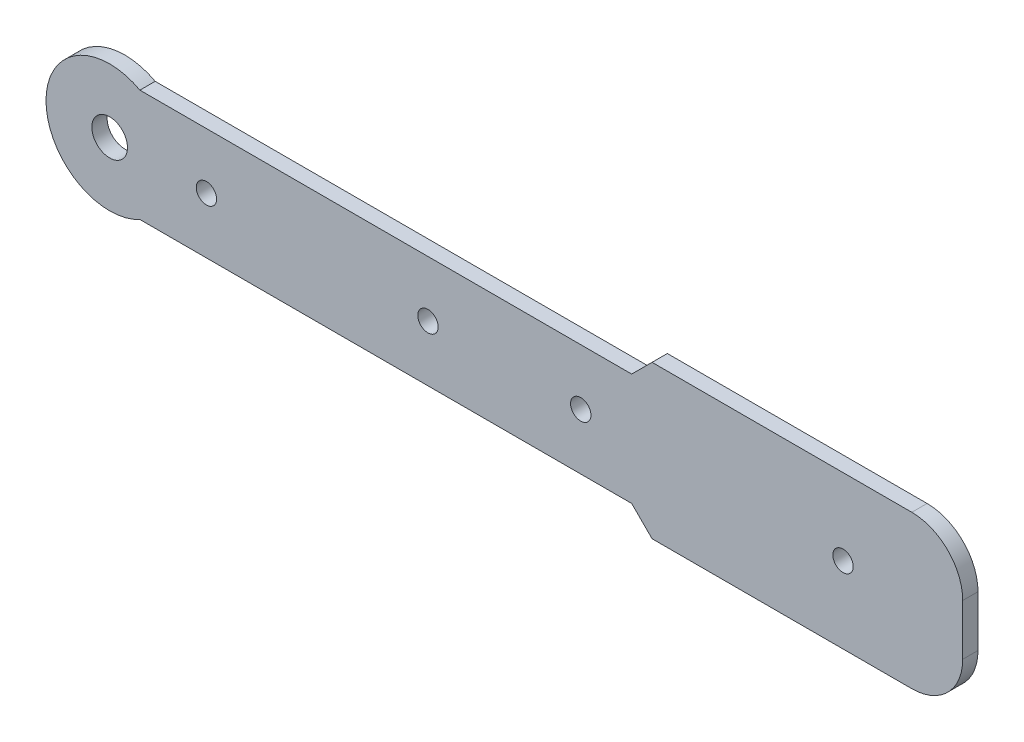
ISO-10303-21;
HEADER;
FILE_DESCRIPTION(('STEP AP214'),'2;1');
FILE_NAME('part.step','',(''),(''),'','','');
FILE_SCHEMA(('AUTOMOTIVE_DESIGN { 1 0 10303 214 1 1 1 1 }'));
ENDSEC;
DATA;
#1=APPLICATION_CONTEXT('core data for automotive mechanical design processes');
#2=APPLICATION_PROTOCOL_DEFINITION('international standard','automotive_design',2000,#1);
#3=PRODUCT_CONTEXT('',#1,'mechanical');
#4=PRODUCT('Part','Part','',(#3));
#5=PRODUCT_RELATED_PRODUCT_CATEGORY('part','',(#4));
#6=PRODUCT_DEFINITION_FORMATION('','',#4);
#7=PRODUCT_DEFINITION_CONTEXT('part definition',#1,'design');
#8=PRODUCT_DEFINITION('design','',#6,#7);
#9=PRODUCT_DEFINITION_SHAPE('','',#8);
#10=(LENGTH_UNIT() NAMED_UNIT(*) SI_UNIT(.MILLI.,.METRE.));
#11=(NAMED_UNIT(*) PLANE_ANGLE_UNIT() SI_UNIT($,.RADIAN.));
#12=(NAMED_UNIT(*) SI_UNIT($,.STERADIAN.) SOLID_ANGLE_UNIT());
#13=UNCERTAINTY_MEASURE_WITH_UNIT(LENGTH_MEASURE(1.E-05),#10,'distance_accuracy_value','');
#14=(GEOMETRIC_REPRESENTATION_CONTEXT(3) GLOBAL_UNCERTAINTY_ASSIGNED_CONTEXT((#13)) GLOBAL_UNIT_ASSIGNED_CONTEXT((#10,
#11,#12)) REPRESENTATION_CONTEXT('',''));
#15=CARTESIAN_POINT('',(0.,0.,0.));
#16=DIRECTION('',(0.,0.,1.));
#17=DIRECTION('',(1.,0.,0.));
#18=AXIS2_PLACEMENT_3D('',#15,#16,#17);
#19=CARTESIAN_POINT('',(25.,15.,3.));
#20=DIRECTION('',(0.,-1.,0.));
#21=DIRECTION('',(1.,0.,0.));
#22=AXIS2_PLACEMENT_3D('',#19,#20,#21);
#23=PLANE('',#22);
#24=DIRECTION('',(-1.,0.,0.));
#25=VECTOR('',#24,1.);
#26=CARTESIAN_POINT('',(25.,15.,0.));
#27=LINE('',#26,#25);
#28=CARTESIAN_POINT('',(80.,15.,0.));
#29=VERTEX_POINT('',#28);
#30=CARTESIAN_POINT('',(29.,15.,0.));
#31=VERTEX_POINT('',#30);
#32=EDGE_CURVE('E245',#29,#31,#27,.T.);
#33=ORIENTED_EDGE('',*,*,#32,.T.);
#34=DIRECTION('',(0.,0.,1.));
#35=VECTOR('',#34,1.);
#36=CARTESIAN_POINT('',(29.,15.,3.));
#37=LINE('',#36,#35);
#38=CARTESIAN_POINT('',(29.,15.,3.));
#39=VERTEX_POINT('',#38);
#40=EDGE_CURVE('E11',#31,#39,#37,.T.);
#41=ORIENTED_EDGE('',*,*,#40,.T.);
#42=DIRECTION('',(-1.,0.,0.));
#43=VECTOR('',#42,1.);
#44=CARTESIAN_POINT('',(25.,15.,3.));
#45=LINE('',#44,#43);
#46=CARTESIAN_POINT('',(80.,15.,3.));
#47=VERTEX_POINT('',#46);
#48=EDGE_CURVE('E128',#47,#39,#45,.T.);
#49=ORIENTED_EDGE('',*,*,#48,.F.);
#50=DIRECTION('',(0.,0.,-1.));
#51=VECTOR('',#50,1.);
#52=CARTESIAN_POINT('',(80.,15.,3.));
#53=LINE('',#52,#51);
#54=EDGE_CURVE('E175',#47,#29,#53,.T.);
#55=ORIENTED_EDGE('',*,*,#54,.T.);
#56=EDGE_LOOP('',(#33,#41,#49,#55));
#57=FACE_BOUND('',#56,.T.);
#58=ADVANCED_FACE('F45',(#57),#23,.F.);
#59=CARTESIAN_POINT('',(-25.,11.,3.));
#60=DIRECTION('',(0.,-1.,0.));
#61=DIRECTION('',(0.,0.,-1.));
#62=AXIS2_PLACEMENT_3D('',#59,#60,#61);
#63=PLANE('',#62);
#64=DIRECTION('',(-1.,0.,0.));
#65=VECTOR('',#64,1.);
#66=CARTESIAN_POINT('',(-25.,11.,0.));
#67=LINE('',#66,#65);
#68=CARTESIAN_POINT('',(25.,11.,0.));
#69=VERTEX_POINT('',#68);
#70=CARTESIAN_POINT('',(-71.562828956481,11.,0.));
#71=VERTEX_POINT('',#70);
#72=EDGE_CURVE('E223',#69,#71,#67,.T.);
#73=ORIENTED_EDGE('',*,*,#72,.T.);
#74=DIRECTION('',(0.,0.,-1.));
#75=VECTOR('',#74,1.);
#76=CARTESIAN_POINT('',(-71.562828956481,11.,3.));
#77=LINE('',#76,#75);
#78=CARTESIAN_POINT('',(-71.562828956481,11.,3.));
#79=VERTEX_POINT('',#78);
#80=EDGE_CURVE('E139',#79,#71,#77,.T.);
#81=ORIENTED_EDGE('',*,*,#80,.F.);
#82=DIRECTION('',(-1.,0.,0.));
#83=VECTOR('',#82,1.);
#84=CARTESIAN_POINT('',(-25.,11.,3.));
#85=LINE('',#84,#83);
#86=CARTESIAN_POINT('',(25.,11.,3.));
#87=VERTEX_POINT('',#86);
#88=EDGE_CURVE('E126',#87,#79,#85,.T.);
#89=ORIENTED_EDGE('',*,*,#88,.F.);
#90=DIRECTION('',(0.,0.,-1.));
#91=VECTOR('',#90,1.);
#92=CARTESIAN_POINT('',(25.,11.,3.));
#93=LINE('',#92,#91);
#94=EDGE_CURVE('E137',#87,#69,#93,.T.);
#95=ORIENTED_EDGE('',*,*,#94,.T.);
#96=EDGE_LOOP('',(#73,#81,#89,#95));
#97=FACE_BOUND('',#96,.T.);
#98=ADVANCED_FACE('F136',(#97),#63,.F.);
#99=CARTESIAN_POINT('',(-77.5,0.,3.));
#100=DIRECTION('',(0.,0.,-1.));
#101=DIRECTION('',(-1.,0.,0.));
#102=AXIS2_PLACEMENT_3D('',#99,#100,#101);
#103=CYLINDRICAL_SURFACE('',#102,12.5);
#104=CARTESIAN_POINT('',(-77.5,0.,0.));
#105=DIRECTION('',(0.,0.,1.));
#106=DIRECTION('',(1.,0.,0.));
#107=AXIS2_PLACEMENT_3D('',#104,#105,#106);
#108=CIRCLE('',#107,12.5);
#109=CARTESIAN_POINT('',(-71.562828956481,-11.,0.));
#110=VERTEX_POINT('',#109);
#111=EDGE_CURVE('E217',#71,#110,#108,.T.);
#112=ORIENTED_EDGE('',*,*,#111,.T.);
#113=DIRECTION('',(0.,0.,-1.));
#114=VECTOR('',#113,1.);
#115=CARTESIAN_POINT('',(-71.562828956481,-11.,3.));
#116=LINE('',#115,#114);
#117=CARTESIAN_POINT('',(-71.562828956481,-11.,3.));
#118=VERTEX_POINT('',#117);
#119=EDGE_CURVE('E151',#118,#110,#116,.T.);
#120=ORIENTED_EDGE('',*,*,#119,.F.);
#121=CARTESIAN_POINT('',(-77.5,0.,3.));
#122=DIRECTION('',(0.,0.,1.));
#123=DIRECTION('',(1.,0.,0.));
#124=AXIS2_PLACEMENT_3D('',#121,#122,#123);
#125=CIRCLE('',#124,12.5);
#126=EDGE_CURVE('E142',#79,#118,#125,.T.);
#127=ORIENTED_EDGE('',*,*,#126,.F.);
#128=ORIENTED_EDGE('',*,*,#80,.T.);
#129=EDGE_LOOP('',(#112,#120,#127,#128));
#130=FACE_BOUND('',#129,.T.);
#131=ADVANCED_FACE('F250',(#130),#103,.T.);
#132=CARTESIAN_POINT('',(-25.,-11.,3.));
#133=DIRECTION('',(0.,1.,0.));
#134=DIRECTION('',(0.,0.,1.));
#135=AXIS2_PLACEMENT_3D('',#132,#133,#134);
#136=PLANE('',#135);
#137=DIRECTION('',(1.,0.,0.));
#138=VECTOR('',#137,1.);
#139=CARTESIAN_POINT('',(-25.,-11.,0.));
#140=LINE('',#139,#138);
#141=CARTESIAN_POINT('',(25.,-11.,0.));
#142=VERTEX_POINT('',#141);
#143=EDGE_CURVE('E209',#110,#142,#140,.T.);
#144=ORIENTED_EDGE('',*,*,#143,.T.);
#145=DIRECTION('',(0.,0.,-1.));
#146=VECTOR('',#145,1.);
#147=CARTESIAN_POINT('',(25.,-11.,3.));
#148=LINE('',#147,#146);
#149=CARTESIAN_POINT('',(25.,-11.,3.));
#150=VERTEX_POINT('',#149);
#151=EDGE_CURVE('E205',#150,#142,#148,.T.);
#152=ORIENTED_EDGE('',*,*,#151,.F.);
#153=DIRECTION('',(1.,0.,0.));
#154=VECTOR('',#153,1.);
#155=CARTESIAN_POINT('',(-25.,-11.,3.));
#156=LINE('',#155,#154);
#157=EDGE_CURVE('E191',#118,#150,#156,.T.);
#158=ORIENTED_EDGE('',*,*,#157,.F.);
#159=ORIENTED_EDGE('',*,*,#119,.T.);
#160=EDGE_LOOP('',(#144,#152,#158,#159));
#161=FACE_BOUND('',#160,.T.);
#162=ADVANCED_FACE('F214',(#161),#136,.F.);
#163=CARTESIAN_POINT('',(25.,-15.,3.));
#164=DIRECTION('',(0.,1.,0.));
#165=DIRECTION('',(-1.,0.,0.));
#166=AXIS2_PLACEMENT_3D('',#163,#164,#165);
#167=PLANE('',#166);
#168=DIRECTION('',(1.,0.,0.));
#169=VECTOR('',#168,1.);
#170=CARTESIAN_POINT('',(25.,-15.,3.));
#171=LINE('',#170,#169);
#172=CARTESIAN_POINT('',(29.,-15.,3.));
#173=VERTEX_POINT('',#172);
#174=CARTESIAN_POINT('',(80.,-15.,3.));
#175=VERTEX_POINT('',#174);
#176=EDGE_CURVE('E189',#173,#175,#171,.T.);
#177=ORIENTED_EDGE('',*,*,#176,.F.);
#178=DIRECTION('',(0.,0.,-1.));
#179=VECTOR('',#178,1.);
#180=CARTESIAN_POINT('',(29.,-15.,3.));
#181=LINE('',#180,#179);
#182=CARTESIAN_POINT('',(29.,-15.,0.));
#183=VERTEX_POINT('',#182);
#184=EDGE_CURVE('E179',#173,#183,#181,.T.);
#185=ORIENTED_EDGE('',*,*,#184,.T.);
#186=DIRECTION('',(1.,0.,0.));
#187=VECTOR('',#186,1.);
#188=CARTESIAN_POINT('',(25.,-15.,0.));
#189=LINE('',#188,#187);
#190=CARTESIAN_POINT('',(80.,-15.,0.));
#191=VERTEX_POINT('',#190);
#192=EDGE_CURVE('E211',#183,#191,#189,.T.);
#193=ORIENTED_EDGE('',*,*,#192,.T.);
#194=DIRECTION('',(0.,0.,-1.));
#195=VECTOR('',#194,1.);
#196=CARTESIAN_POINT('',(80.,-15.,3.));
#197=LINE('',#196,#195);
#198=EDGE_CURVE('E165',#191,#175,#197,.F.);
#199=ORIENTED_EDGE('',*,*,#198,.T.);
#200=EDGE_LOOP('',(#177,#185,#193,#199));
#201=FACE_BOUND('',#200,.T.);
#202=ADVANCED_FACE('F197',(#201),#167,.F.);
#203=CARTESIAN_POINT('',(90.,-15.,3.));
#204=DIRECTION('',(-1.,0.,0.));
#205=DIRECTION('',(0.,-1.,0.));
#206=AXIS2_PLACEMENT_3D('',#203,#204,#205);
#207=PLANE('',#206);
#208=DIRECTION('',(0.,1.,0.));
#209=VECTOR('',#208,1.);
#210=CARTESIAN_POINT('',(90.,-15.,3.));
#211=LINE('',#210,#209);
#212=CARTESIAN_POINT('',(90.,-4.99999999999998,3.));
#213=VERTEX_POINT('',#212);
#214=CARTESIAN_POINT('',(90.,5.00000000000001,3.));
#215=VERTEX_POINT('',#214);
#216=EDGE_CURVE('E202',#213,#215,#211,.T.);
#217=ORIENTED_EDGE('',*,*,#216,.F.);
#218=DIRECTION('',(0.,0.,-1.));
#219=VECTOR('',#218,1.);
#220=CARTESIAN_POINT('',(90.,-4.99999999999998,3.));
#221=LINE('',#220,#219);
#222=CARTESIAN_POINT('',(90.,-4.99999999999998,0.));
#223=VERTEX_POINT('',#222);
#224=EDGE_CURVE('E149',#213,#223,#221,.T.);
#225=ORIENTED_EDGE('',*,*,#224,.T.);
#226=DIRECTION('',(0.,1.,0.));
#227=VECTOR('',#226,1.);
#228=CARTESIAN_POINT('',(90.,-15.,0.));
#229=LINE('',#228,#227);
#230=CARTESIAN_POINT('',(90.,5.00000000000001,0.));
#231=VERTEX_POINT('',#230);
#232=EDGE_CURVE('E221',#223,#231,#229,.T.);
#233=ORIENTED_EDGE('',*,*,#232,.T.);
#234=DIRECTION('',(0.,0.,-1.));
#235=VECTOR('',#234,1.);
#236=CARTESIAN_POINT('',(90.,5.00000000000001,3.));
#237=LINE('',#236,#235);
#238=EDGE_CURVE('E145',#231,#215,#237,.F.);
#239=ORIENTED_EDGE('',*,*,#238,.T.);
#240=EDGE_LOOP('',(#217,#225,#233,#239));
#241=FACE_BOUND('',#240,.T.);
#242=ADVANCED_FACE('F297',(#241),#207,.F.);
#243=CARTESIAN_POINT('',(-77.5,0.,3.));
#244=DIRECTION('',(0.,0.,1.));
#245=DIRECTION('',(1.,0.,0.));
#246=AXIS2_PLACEMENT_3D('',#243,#244,#245);
#247=PLANE('',#246);
#248=CARTESIAN_POINT('',(66.5,0.,3.));
#249=DIRECTION('',(0.,0.,1.));
#250=DIRECTION('',(1.,0.,0.));
#251=AXIS2_PLACEMENT_3D('',#248,#249,#250);
#252=CIRCLE('',#251,2.);
#253=CARTESIAN_POINT('',(68.5,0.,3.));
#254=VERTEX_POINT('',#253);
#255=EDGE_CURVE('E440',#254,#254,#252,.T.);
#256=ORIENTED_EDGE('',*,*,#255,.F.);
#257=EDGE_LOOP('',(#256));
#258=FACE_BOUND('',#257,.T.);
#259=CARTESIAN_POINT('',(-15.,0.,3.));
#260=DIRECTION('',(0.,0.,1.));
#261=DIRECTION('',(1.,0.,0.));
#262=AXIS2_PLACEMENT_3D('',#259,#260,#261);
#263=CIRCLE('',#262,2.);
#264=CARTESIAN_POINT('',(-13.,0.,3.));
#265=VERTEX_POINT('',#264);
#266=EDGE_CURVE('E454',#265,#265,#263,.T.);
#267=ORIENTED_EDGE('',*,*,#266,.F.);
#268=EDGE_LOOP('',(#267));
#269=FACE_BOUND('',#268,.T.);
#270=CARTESIAN_POINT('',(15.,0.,3.));
#271=DIRECTION('',(0.,0.,1.));
#272=DIRECTION('',(1.,0.,0.));
#273=AXIS2_PLACEMENT_3D('',#270,#271,#272);
#274=CIRCLE('',#273,2.);
#275=CARTESIAN_POINT('',(17.,0.,3.));
#276=VERTEX_POINT('',#275);
#277=EDGE_CURVE('E450',#276,#276,#274,.T.);
#278=ORIENTED_EDGE('',*,*,#277,.F.);
#279=EDGE_LOOP('',(#278));
#280=FACE_BOUND('',#279,.T.);
#281=CARTESIAN_POINT('',(-77.5,0.,3.));
#282=DIRECTION('',(0.,0.,1.));
#283=DIRECTION('',(1.,0.,0.));
#284=AXIS2_PLACEMENT_3D('',#281,#282,#283);
#285=CIRCLE('',#284,3.50000000000001);
#286=CARTESIAN_POINT('',(-74.,0.,3.));
#287=VERTEX_POINT('',#286);
#288=EDGE_CURVE('E466',#287,#287,#285,.T.);
#289=ORIENTED_EDGE('',*,*,#288,.F.);
#290=EDGE_LOOP('',(#289));
#291=FACE_BOUND('',#290,.T.);
#292=CARTESIAN_POINT('',(-58.5,0.,3.));
#293=DIRECTION('',(0.,0.,1.));
#294=DIRECTION('',(1.,0.,0.));
#295=AXIS2_PLACEMENT_3D('',#292,#293,#294);
#296=CIRCLE('',#295,2.);
#297=CARTESIAN_POINT('',(-56.5,0.,3.));
#298=VERTEX_POINT('',#297);
#299=EDGE_CURVE('E242',#298,#298,#296,.T.);
#300=ORIENTED_EDGE('',*,*,#299,.F.);
#301=EDGE_LOOP('',(#300));
#302=FACE_BOUND('',#301,.T.);
#303=ORIENTED_EDGE('',*,*,#157,.T.);
#304=DIRECTION('',(-0.707106781186545,0.70710678118655,0.));
#305=VECTOR('',#304,1.);
#306=CARTESIAN_POINT('',(-31.7499999999996,45.7500000000001,3.));
#307=LINE('',#306,#305);
#308=EDGE_CURVE('E55',#150,#173,#307,.F.);
#309=ORIENTED_EDGE('',*,*,#308,.T.);
#310=ORIENTED_EDGE('',*,*,#176,.T.);
#311=CARTESIAN_POINT('',(80.,-4.99999999999997,3.));
#312=DIRECTION('',(0.,0.,1.));
#313=DIRECTION('',(1.,0.,0.));
#314=AXIS2_PLACEMENT_3D('',#311,#312,#313);
#315=CIRCLE('',#314,10.);
#316=EDGE_CURVE('E172',#175,#213,#315,.T.);
#317=ORIENTED_EDGE('',*,*,#316,.T.);
#318=ORIENTED_EDGE('',*,*,#216,.T.);
#319=CARTESIAN_POINT('',(80.,5.00000000000001,3.));
#320=DIRECTION('',(0.,0.,1.));
#321=DIRECTION('',(1.,0.,0.));
#322=AXIS2_PLACEMENT_3D('',#319,#320,#321);
#323=CIRCLE('',#322,10.);
#324=EDGE_CURVE('E169',#215,#47,#323,.T.);
#325=ORIENTED_EDGE('',*,*,#324,.T.);
#326=ORIENTED_EDGE('',*,*,#48,.T.);
#327=DIRECTION('',(0.70710678118655,0.707106781186545,0.));
#328=VECTOR('',#327,1.);
#329=CARTESIAN_POINT('',(-31.7500000000004,-45.75,3.));
#330=LINE('',#329,#328);
#331=EDGE_CURVE('E123',#39,#87,#330,.F.);
#332=ORIENTED_EDGE('',*,*,#331,.T.);
#333=ORIENTED_EDGE('',*,*,#88,.T.);
#334=ORIENTED_EDGE('',*,*,#126,.T.);
#335=EDGE_LOOP('',(#303,#309,#310,#317,#318,#325,#326,#332,#333,#334));
#336=FACE_BOUND('',#335,.T.);
#337=ADVANCED_FACE('F125',(#258,#269,#280,#291,#302,#336),#247,.T.);
#338=CARTESIAN_POINT('',(-77.5,0.,0.));
#339=DIRECTION('',(0.,0.,1.));
#340=DIRECTION('',(1.,0.,0.));
#341=AXIS2_PLACEMENT_3D('',#338,#339,#340);
#342=PLANE('',#341);
#343=CARTESIAN_POINT('',(66.5,0.,0.));
#344=DIRECTION('',(0.,0.,1.));
#345=DIRECTION('',(1.,0.,0.));
#346=AXIS2_PLACEMENT_3D('',#343,#344,#345);
#347=CIRCLE('',#346,2.);
#348=CARTESIAN_POINT('',(68.5,0.,0.));
#349=VERTEX_POINT('',#348);
#350=EDGE_CURVE('E443',#349,#349,#347,.F.);
#351=ORIENTED_EDGE('',*,*,#350,.F.);
#352=EDGE_LOOP('',(#351));
#353=FACE_BOUND('',#352,.T.);
#354=CARTESIAN_POINT('',(-15.,0.,0.));
#355=DIRECTION('',(0.,0.,1.));
#356=DIRECTION('',(1.,0.,0.));
#357=AXIS2_PLACEMENT_3D('',#354,#355,#356);
#358=CIRCLE('',#357,2.);
#359=CARTESIAN_POINT('',(-13.,0.,0.));
#360=VERTEX_POINT('',#359);
#361=EDGE_CURVE('E458',#360,#360,#358,.F.);
#362=ORIENTED_EDGE('',*,*,#361,.F.);
#363=EDGE_LOOP('',(#362));
#364=FACE_BOUND('',#363,.T.);
#365=CARTESIAN_POINT('',(15.,0.,0.));
#366=DIRECTION('',(0.,0.,1.));
#367=DIRECTION('',(1.,0.,0.));
#368=AXIS2_PLACEMENT_3D('',#365,#366,#367);
#369=CIRCLE('',#368,2.);
#370=CARTESIAN_POINT('',(17.,0.,0.));
#371=VERTEX_POINT('',#370);
#372=EDGE_CURVE('E445',#371,#371,#369,.F.);
#373=ORIENTED_EDGE('',*,*,#372,.F.);
#374=EDGE_LOOP('',(#373));
#375=FACE_BOUND('',#374,.T.);
#376=CARTESIAN_POINT('',(-77.5,0.,0.));
#377=DIRECTION('',(0.,0.,1.));
#378=DIRECTION('',(1.,0.,0.));
#379=AXIS2_PLACEMENT_3D('',#376,#377,#378);
#380=CIRCLE('',#379,3.50000000000001);
#381=CARTESIAN_POINT('',(-74.,0.,0.));
#382=VERTEX_POINT('',#381);
#383=EDGE_CURVE('E247',#382,#382,#380,.F.);
#384=ORIENTED_EDGE('',*,*,#383,.F.);
#385=EDGE_LOOP('',(#384));
#386=FACE_BOUND('',#385,.T.);
#387=CARTESIAN_POINT('',(-58.5,0.,0.));
#388=DIRECTION('',(0.,0.,1.));
#389=DIRECTION('',(1.,0.,0.));
#390=AXIS2_PLACEMENT_3D('',#387,#388,#389);
#391=CIRCLE('',#390,2.);
#392=CARTESIAN_POINT('',(-56.5,0.,0.));
#393=VERTEX_POINT('',#392);
#394=EDGE_CURVE('E461',#393,#393,#391,.F.);
#395=ORIENTED_EDGE('',*,*,#394,.F.);
#396=EDGE_LOOP('',(#395));
#397=FACE_BOUND('',#396,.T.);
#398=ORIENTED_EDGE('',*,*,#192,.F.);
#399=DIRECTION('',(0.707106781186545,-0.70710678118655,0.));
#400=VECTOR('',#399,1.);
#401=CARTESIAN_POINT('',(29.,-15.,0.));
#402=LINE('',#401,#400);
#403=EDGE_CURVE('E132',#183,#142,#402,.F.);
#404=ORIENTED_EDGE('',*,*,#403,.T.);
#405=ORIENTED_EDGE('',*,*,#143,.F.);
#406=ORIENTED_EDGE('',*,*,#111,.F.);
#407=ORIENTED_EDGE('',*,*,#72,.F.);
#408=DIRECTION('',(-0.70710678118655,-0.707106781186545,0.));
#409=VECTOR('',#408,1.);
#410=CARTESIAN_POINT('',(25.,11.,0.));
#411=LINE('',#410,#409);
#412=EDGE_CURVE('E68',#69,#31,#411,.F.);
#413=ORIENTED_EDGE('',*,*,#412,.T.);
#414=ORIENTED_EDGE('',*,*,#32,.F.);
#415=CARTESIAN_POINT('',(80.,5.00000000000001,0.));
#416=DIRECTION('',(0.,0.,1.));
#417=DIRECTION('',(1.,0.,0.));
#418=AXIS2_PLACEMENT_3D('',#415,#416,#417);
#419=CIRCLE('',#418,10.);
#420=EDGE_CURVE('E158',#29,#231,#419,.F.);
#421=ORIENTED_EDGE('',*,*,#420,.T.);
#422=ORIENTED_EDGE('',*,*,#232,.F.);
#423=CARTESIAN_POINT('',(80.,-4.99999999999997,0.));
#424=DIRECTION('',(0.,0.,1.));
#425=DIRECTION('',(1.,0.,0.));
#426=AXIS2_PLACEMENT_3D('',#423,#424,#425);
#427=CIRCLE('',#426,10.);
#428=EDGE_CURVE('E161',#223,#191,#427,.F.);
#429=ORIENTED_EDGE('',*,*,#428,.T.);
#430=EDGE_LOOP('',(#398,#404,#405,#406,#407,#413,#414,#421,#422,#429));
#431=FACE_BOUND('',#430,.T.);
#432=ADVANCED_FACE('F207',(#353,#364,#375,#386,#397,#431),#342,.F.);
#433=CARTESIAN_POINT('',(80.,-4.99999999999997,3.));
#434=DIRECTION('',(0.,0.,-1.));
#435=DIRECTION('',(-1.,0.,0.));
#436=AXIS2_PLACEMENT_3D('',#433,#434,#435);
#437=CYLINDRICAL_SURFACE('',#436,10.);
#438=ORIENTED_EDGE('',*,*,#316,.F.);
#439=ORIENTED_EDGE('',*,*,#198,.F.);
#440=ORIENTED_EDGE('',*,*,#428,.F.);
#441=ORIENTED_EDGE('',*,*,#224,.F.);
#442=EDGE_LOOP('',(#438,#439,#440,#441));
#443=FACE_BOUND('',#442,.T.);
#444=ADVANCED_FACE('F264',(#443),#437,.T.);
#445=CARTESIAN_POINT('',(80.,5.00000000000001,3.));
#446=DIRECTION('',(0.,0.,-1.));
#447=DIRECTION('',(-1.,0.,0.));
#448=AXIS2_PLACEMENT_3D('',#445,#446,#447);
#449=CYLINDRICAL_SURFACE('',#448,10.);
#450=ORIENTED_EDGE('',*,*,#324,.F.);
#451=ORIENTED_EDGE('',*,*,#238,.F.);
#452=ORIENTED_EDGE('',*,*,#420,.F.);
#453=ORIENTED_EDGE('',*,*,#54,.F.);
#454=EDGE_LOOP('',(#450,#451,#452,#453));
#455=FACE_BOUND('',#454,.T.);
#456=ADVANCED_FACE('F267',(#455),#449,.T.);
#457=CARTESIAN_POINT('',(29.,-15.,3.));
#458=DIRECTION('',(0.70710678118655,0.707106781186545,0.));
#459=DIRECTION('',(0.,0.,-1.));
#460=AXIS2_PLACEMENT_3D('',#457,#458,#459);
#461=PLANE('',#460);
#462=ORIENTED_EDGE('',*,*,#308,.F.);
#463=ORIENTED_EDGE('',*,*,#151,.T.);
#464=ORIENTED_EDGE('',*,*,#403,.F.);
#465=ORIENTED_EDGE('',*,*,#184,.F.);
#466=EDGE_LOOP('',(#462,#463,#464,#465));
#467=FACE_BOUND('',#466,.T.);
#468=ADVANCED_FACE('F204',(#467),#461,.F.);
#469=CARTESIAN_POINT('',(25.,11.,3.));
#470=DIRECTION('',(0.707106781186545,-0.70710678118655,0.));
#471=DIRECTION('',(0.,0.,-1.));
#472=AXIS2_PLACEMENT_3D('',#469,#470,#471);
#473=PLANE('',#472);
#474=ORIENTED_EDGE('',*,*,#331,.F.);
#475=ORIENTED_EDGE('',*,*,#40,.F.);
#476=ORIENTED_EDGE('',*,*,#412,.F.);
#477=ORIENTED_EDGE('',*,*,#94,.F.);
#478=EDGE_LOOP('',(#474,#475,#476,#477));
#479=FACE_BOUND('',#478,.T.);
#480=ADVANCED_FACE('F48',(#479),#473,.F.);
#481=CARTESIAN_POINT('',(-58.5,0.,-0.00100000000000013));
#482=DIRECTION('',(0.,0.,1.));
#483=DIRECTION('',(1.,0.,0.));
#484=AXIS2_PLACEMENT_3D('',#481,#482,#483);
#485=CYLINDRICAL_SURFACE('',#484,2.);
#486=CARTESIAN_POINT('',(-56.5,0.,3.));
#487=CARTESIAN_POINT('',(-56.5,0.,2.96875));
#488=CARTESIAN_POINT('',(-56.5,0.,2.9375));
#489=CARTESIAN_POINT('',(-56.5,0.,2.875));
#490=CARTESIAN_POINT('',(-56.5,0.,2.84375));
#491=CARTESIAN_POINT('',(-56.5,0.,2.78125));
#492=CARTESIAN_POINT('',(-56.5,0.,2.75));
#493=CARTESIAN_POINT('',(-56.5,0.,2.6875));
#494=CARTESIAN_POINT('',(-56.5,0.,2.65625));
#495=CARTESIAN_POINT('',(-56.5,0.,2.59375));
#496=CARTESIAN_POINT('',(-56.5,0.,2.5625));
#497=CARTESIAN_POINT('',(-56.5,0.,2.5));
#498=CARTESIAN_POINT('',(-56.5,0.,2.46875));
#499=CARTESIAN_POINT('',(-56.5,0.,2.40625));
#500=CARTESIAN_POINT('',(-56.5,0.,2.375));
#501=CARTESIAN_POINT('',(-56.5,0.,2.3125));
#502=CARTESIAN_POINT('',(-56.5,0.,2.28125));
#503=CARTESIAN_POINT('',(-56.5,0.,2.21875));
#504=CARTESIAN_POINT('',(-56.5,0.,2.1875));
#505=CARTESIAN_POINT('',(-56.5,0.,2.125));
#506=CARTESIAN_POINT('',(-56.5,0.,2.09375));
#507=CARTESIAN_POINT('',(-56.5,0.,2.03125));
#508=CARTESIAN_POINT('',(-56.5,0.,2.));
#509=CARTESIAN_POINT('',(-56.5,0.,1.9375));
#510=CARTESIAN_POINT('',(-56.5,0.,1.90625));
#511=CARTESIAN_POINT('',(-56.5,0.,1.84375));
#512=CARTESIAN_POINT('',(-56.5,0.,1.8125));
#513=CARTESIAN_POINT('',(-56.5,0.,1.75));
#514=CARTESIAN_POINT('',(-56.5,0.,1.71875));
#515=CARTESIAN_POINT('',(-56.5,0.,1.65625));
#516=CARTESIAN_POINT('',(-56.5,0.,1.625));
#517=CARTESIAN_POINT('',(-56.5,0.,1.5625));
#518=CARTESIAN_POINT('',(-56.5,0.,1.53125));
#519=CARTESIAN_POINT('',(-56.5,0.,1.46875));
#520=CARTESIAN_POINT('',(-56.5,0.,1.4375));
#521=CARTESIAN_POINT('',(-56.5,0.,1.375));
#522=CARTESIAN_POINT('',(-56.5,0.,1.34375));
#523=CARTESIAN_POINT('',(-56.5,0.,1.28125));
#524=CARTESIAN_POINT('',(-56.5,0.,1.25));
#525=CARTESIAN_POINT('',(-56.5,0.,1.1875));
#526=CARTESIAN_POINT('',(-56.5,0.,1.15625));
#527=CARTESIAN_POINT('',(-56.5,0.,1.09375));
#528=CARTESIAN_POINT('',(-56.5,0.,1.0625));
#529=CARTESIAN_POINT('',(-56.5,0.,1.));
#530=CARTESIAN_POINT('',(-56.5,0.,0.96875));
#531=CARTESIAN_POINT('',(-56.5,0.,0.90625));
#532=CARTESIAN_POINT('',(-56.5,0.,0.875));
#533=CARTESIAN_POINT('',(-56.5,0.,0.8125));
#534=CARTESIAN_POINT('',(-56.5,0.,0.78125));
#535=CARTESIAN_POINT('',(-56.5,0.,0.71875));
#536=CARTESIAN_POINT('',(-56.5,0.,0.6875));
#537=CARTESIAN_POINT('',(-56.5,0.,0.625));
#538=CARTESIAN_POINT('',(-56.5,0.,0.59375));
#539=CARTESIAN_POINT('',(-56.5,0.,0.53125));
#540=CARTESIAN_POINT('',(-56.5,0.,0.5));
#541=CARTESIAN_POINT('',(-56.5,0.,0.4375));
#542=CARTESIAN_POINT('',(-56.5,0.,0.40625));
#543=CARTESIAN_POINT('',(-56.5,0.,0.34375));
#544=CARTESIAN_POINT('',(-56.5,0.,0.3125));
#545=CARTESIAN_POINT('',(-56.5,0.,0.25));
#546=CARTESIAN_POINT('',(-56.5,0.,0.21875));
#547=CARTESIAN_POINT('',(-56.5,0.,0.15625));
#548=CARTESIAN_POINT('',(-56.5,0.,0.125));
#549=CARTESIAN_POINT('',(-56.5,0.,0.0625000000000001));
#550=CARTESIAN_POINT('',(-56.5,0.,0.0312500000000001));
#551=CARTESIAN_POINT('',(-56.5,0.,0.));
#552=B_SPLINE_CURVE_WITH_KNOTS('',3,(#486,#487,#488,#489,#490,#491,#492,#493,#494,#495,#496,
#497,#498,#499,#500,#501,#502,#503,#504,#505,#506,#507,#508,#509,#510,#511,#512,#513,#514,#515,
#516,#517,#518,#519,#520,#521,#522,#523,#524,#525,#526,#527,#528,#529,#530,#531,#532,#533,#534,
#535,#536,#537,#538,#539,#540,#541,#542,#543,#544,#545,#546,#547,#548,#549,#550,#551),
.UNSPECIFIED.,.F.,.F.,(4,2,2,2,2,2,2,2,2,2,2,2,2,2,2,2,2,2,2,2,2,2,2,2,2,2,2,2,2,2,2,2,4),(0.,
0.0937500000000001,0.1875,0.28125,0.375,0.46875,0.5625,0.65625,0.75,0.84375,0.9375,1.03125,
1.125,1.21875,1.3125,1.40625,1.5,1.59375,1.6875,1.78125,1.875,1.96875,2.0625,2.15625,2.25,
2.34375,2.4375,2.53125,2.625,2.71875,2.8125,2.90625,3.),.UNSPECIFIED.);
#553=EDGE_CURVE('BSEAM278',#298,#393,#552,.T.);
#554=ORIENTED_EDGE('',*,*,#299,.T.);
#555=ORIENTED_EDGE('',*,*,#394,.T.);
#556=ORIENTED_EDGE('',*,*,#553,.T.);
#557=ORIENTED_EDGE('',*,*,#553,.F.);
#558=EDGE_LOOP('',(#554,#556,#555,#557));
#559=FACE_BOUND('',#558,.T.);
#560=ADVANCED_FACE('F278',(#559),#485,.F.);
#561=CARTESIAN_POINT('',(-77.5,0.,-0.00100000000000013));
#562=DIRECTION('',(0.,0.,1.));
#563=DIRECTION('',(1.,0.,0.));
#564=AXIS2_PLACEMENT_3D('',#561,#562,#563);
#565=CYLINDRICAL_SURFACE('',#564,3.50000000000001);
#566=CARTESIAN_POINT('',(-74.,0.,3.));
#567=CARTESIAN_POINT('',(-74.,0.,2.96875));
#568=CARTESIAN_POINT('',(-74.,0.,2.9375));
#569=CARTESIAN_POINT('',(-74.,0.,2.875));
#570=CARTESIAN_POINT('',(-74.,0.,2.84375));
#571=CARTESIAN_POINT('',(-74.,0.,2.78125));
#572=CARTESIAN_POINT('',(-74.,0.,2.75));
#573=CARTESIAN_POINT('',(-74.,0.,2.6875));
#574=CARTESIAN_POINT('',(-74.,0.,2.65625));
#575=CARTESIAN_POINT('',(-74.,0.,2.59375));
#576=CARTESIAN_POINT('',(-74.,0.,2.5625));
#577=CARTESIAN_POINT('',(-74.,0.,2.5));
#578=CARTESIAN_POINT('',(-74.,0.,2.46875));
#579=CARTESIAN_POINT('',(-74.,0.,2.40625));
#580=CARTESIAN_POINT('',(-74.,0.,2.375));
#581=CARTESIAN_POINT('',(-74.,0.,2.3125));
#582=CARTESIAN_POINT('',(-74.,0.,2.28125));
#583=CARTESIAN_POINT('',(-74.,0.,2.21875));
#584=CARTESIAN_POINT('',(-74.,0.,2.1875));
#585=CARTESIAN_POINT('',(-74.,0.,2.125));
#586=CARTESIAN_POINT('',(-74.,0.,2.09375));
#587=CARTESIAN_POINT('',(-74.,0.,2.03125));
#588=CARTESIAN_POINT('',(-74.,0.,2.));
#589=CARTESIAN_POINT('',(-74.,0.,1.9375));
#590=CARTESIAN_POINT('',(-74.,0.,1.90625));
#591=CARTESIAN_POINT('',(-74.,0.,1.84375));
#592=CARTESIAN_POINT('',(-74.,0.,1.8125));
#593=CARTESIAN_POINT('',(-74.,0.,1.75));
#594=CARTESIAN_POINT('',(-74.,0.,1.71875));
#595=CARTESIAN_POINT('',(-74.,0.,1.65625));
#596=CARTESIAN_POINT('',(-74.,0.,1.625));
#597=CARTESIAN_POINT('',(-74.,0.,1.5625));
#598=CARTESIAN_POINT('',(-74.,0.,1.53125));
#599=CARTESIAN_POINT('',(-74.,0.,1.46875));
#600=CARTESIAN_POINT('',(-74.,0.,1.4375));
#601=CARTESIAN_POINT('',(-74.,0.,1.375));
#602=CARTESIAN_POINT('',(-74.,0.,1.34375));
#603=CARTESIAN_POINT('',(-74.,0.,1.28125));
#604=CARTESIAN_POINT('',(-74.,0.,1.25));
#605=CARTESIAN_POINT('',(-74.,0.,1.1875));
#606=CARTESIAN_POINT('',(-74.,0.,1.15625));
#607=CARTESIAN_POINT('',(-74.,0.,1.09375));
#608=CARTESIAN_POINT('',(-74.,0.,1.0625));
#609=CARTESIAN_POINT('',(-74.,0.,1.));
#610=CARTESIAN_POINT('',(-74.,0.,0.96875));
#611=CARTESIAN_POINT('',(-74.,0.,0.90625));
#612=CARTESIAN_POINT('',(-74.,0.,0.875));
#613=CARTESIAN_POINT('',(-74.,0.,0.8125));
#614=CARTESIAN_POINT('',(-74.,0.,0.78125));
#615=CARTESIAN_POINT('',(-74.,0.,0.71875));
#616=CARTESIAN_POINT('',(-74.,0.,0.6875));
#617=CARTESIAN_POINT('',(-74.,0.,0.625));
#618=CARTESIAN_POINT('',(-74.,0.,0.59375));
#619=CARTESIAN_POINT('',(-74.,0.,0.53125));
#620=CARTESIAN_POINT('',(-74.,0.,0.5));
#621=CARTESIAN_POINT('',(-74.,0.,0.4375));
#622=CARTESIAN_POINT('',(-74.,0.,0.40625));
#623=CARTESIAN_POINT('',(-74.,0.,0.34375));
#624=CARTESIAN_POINT('',(-74.,0.,0.3125));
#625=CARTESIAN_POINT('',(-74.,0.,0.25));
#626=CARTESIAN_POINT('',(-74.,0.,0.21875));
#627=CARTESIAN_POINT('',(-74.,0.,0.15625));
#628=CARTESIAN_POINT('',(-74.,0.,0.125));
#629=CARTESIAN_POINT('',(-74.,0.,0.0625000000000001));
#630=CARTESIAN_POINT('',(-74.,0.,0.0312500000000001));
#631=CARTESIAN_POINT('',(-74.,0.,0.));
#632=B_SPLINE_CURVE_WITH_KNOTS('',3,(#566,#567,#568,#569,#570,#571,#572,#573,#574,#575,#576,
#577,#578,#579,#580,#581,#582,#583,#584,#585,#586,#587,#588,#589,#590,#591,#592,#593,#594,#595,
#596,#597,#598,#599,#600,#601,#602,#603,#604,#605,#606,#607,#608,#609,#610,#611,#612,#613,#614,
#615,#616,#617,#618,#619,#620,#621,#622,#623,#624,#625,#626,#627,#628,#629,#630,#631),
.UNSPECIFIED.,.F.,.F.,(4,2,2,2,2,2,2,2,2,2,2,2,2,2,2,2,2,2,2,2,2,2,2,2,2,2,2,2,2,2,2,2,4),(0.,
0.0937500000000001,0.1875,0.28125,0.375,0.46875,0.5625,0.65625,0.75,0.84375,0.9375,1.03125,
1.125,1.21875,1.3125,1.40625,1.5,1.59375,1.6875,1.78125,1.875,1.96875,2.0625,2.15625,2.25,
2.34375,2.4375,2.53125,2.625,2.71875,2.8125,2.90625,3.),.UNSPECIFIED.);
#633=EDGE_CURVE('BSEAM282',#287,#382,#632,.T.);
#634=ORIENTED_EDGE('',*,*,#288,.T.);
#635=ORIENTED_EDGE('',*,*,#383,.T.);
#636=ORIENTED_EDGE('',*,*,#633,.T.);
#637=ORIENTED_EDGE('',*,*,#633,.F.);
#638=EDGE_LOOP('',(#634,#636,#635,#637));
#639=FACE_BOUND('',#638,.T.);
#640=ADVANCED_FACE('F282',(#639),#565,.F.);
#641=CARTESIAN_POINT('',(15.,0.,-0.00100000000000013));
#642=DIRECTION('',(0.,0.,1.));
#643=DIRECTION('',(1.,0.,0.));
#644=AXIS2_PLACEMENT_3D('',#641,#642,#643);
#645=CYLINDRICAL_SURFACE('',#644,2.);
#646=CARTESIAN_POINT('',(17.,0.,3.));
#647=CARTESIAN_POINT('',(17.,0.,2.96875));
#648=CARTESIAN_POINT('',(17.,0.,2.9375));
#649=CARTESIAN_POINT('',(17.,0.,2.875));
#650=CARTESIAN_POINT('',(17.,0.,2.84375));
#651=CARTESIAN_POINT('',(17.,0.,2.78125));
#652=CARTESIAN_POINT('',(17.,0.,2.75));
#653=CARTESIAN_POINT('',(17.,0.,2.6875));
#654=CARTESIAN_POINT('',(17.,0.,2.65625));
#655=CARTESIAN_POINT('',(17.,0.,2.59375));
#656=CARTESIAN_POINT('',(17.,0.,2.5625));
#657=CARTESIAN_POINT('',(17.,0.,2.5));
#658=CARTESIAN_POINT('',(17.,0.,2.46875));
#659=CARTESIAN_POINT('',(17.,0.,2.40625));
#660=CARTESIAN_POINT('',(17.,0.,2.375));
#661=CARTESIAN_POINT('',(17.,0.,2.3125));
#662=CARTESIAN_POINT('',(17.,0.,2.28125));
#663=CARTESIAN_POINT('',(17.,0.,2.21875));
#664=CARTESIAN_POINT('',(17.,0.,2.1875));
#665=CARTESIAN_POINT('',(17.,0.,2.125));
#666=CARTESIAN_POINT('',(17.,0.,2.09375));
#667=CARTESIAN_POINT('',(17.,0.,2.03125));
#668=CARTESIAN_POINT('',(17.,0.,2.));
#669=CARTESIAN_POINT('',(17.,0.,1.9375));
#670=CARTESIAN_POINT('',(17.,0.,1.90625));
#671=CARTESIAN_POINT('',(17.,0.,1.84375));
#672=CARTESIAN_POINT('',(17.,0.,1.8125));
#673=CARTESIAN_POINT('',(17.,0.,1.75));
#674=CARTESIAN_POINT('',(17.,0.,1.71875));
#675=CARTESIAN_POINT('',(17.,0.,1.65625));
#676=CARTESIAN_POINT('',(17.,0.,1.625));
#677=CARTESIAN_POINT('',(17.,0.,1.5625));
#678=CARTESIAN_POINT('',(17.,0.,1.53125));
#679=CARTESIAN_POINT('',(17.,0.,1.46875));
#680=CARTESIAN_POINT('',(17.,0.,1.4375));
#681=CARTESIAN_POINT('',(17.,0.,1.375));
#682=CARTESIAN_POINT('',(17.,0.,1.34375));
#683=CARTESIAN_POINT('',(17.,0.,1.28125));
#684=CARTESIAN_POINT('',(17.,0.,1.25));
#685=CARTESIAN_POINT('',(17.,0.,1.1875));
#686=CARTESIAN_POINT('',(17.,0.,1.15625));
#687=CARTESIAN_POINT('',(17.,0.,1.09375));
#688=CARTESIAN_POINT('',(17.,0.,1.0625));
#689=CARTESIAN_POINT('',(17.,0.,1.));
#690=CARTESIAN_POINT('',(17.,0.,0.96875));
#691=CARTESIAN_POINT('',(17.,0.,0.90625));
#692=CARTESIAN_POINT('',(17.,0.,0.875));
#693=CARTESIAN_POINT('',(17.,0.,0.8125));
#694=CARTESIAN_POINT('',(17.,0.,0.78125));
#695=CARTESIAN_POINT('',(17.,0.,0.71875));
#696=CARTESIAN_POINT('',(17.,0.,0.6875));
#697=CARTESIAN_POINT('',(17.,0.,0.625));
#698=CARTESIAN_POINT('',(17.,0.,0.59375));
#699=CARTESIAN_POINT('',(17.,0.,0.53125));
#700=CARTESIAN_POINT('',(17.,0.,0.5));
#701=CARTESIAN_POINT('',(17.,0.,0.4375));
#702=CARTESIAN_POINT('',(17.,0.,0.40625));
#703=CARTESIAN_POINT('',(17.,0.,0.34375));
#704=CARTESIAN_POINT('',(17.,0.,0.3125));
#705=CARTESIAN_POINT('',(17.,0.,0.25));
#706=CARTESIAN_POINT('',(17.,0.,0.21875));
#707=CARTESIAN_POINT('',(17.,0.,0.15625));
#708=CARTESIAN_POINT('',(17.,0.,0.125));
#709=CARTESIAN_POINT('',(17.,0.,0.0625000000000001));
#710=CARTESIAN_POINT('',(17.,0.,0.0312500000000001));
#711=CARTESIAN_POINT('',(17.,0.,0.));
#712=B_SPLINE_CURVE_WITH_KNOTS('',3,(#646,#647,#648,#649,#650,#651,#652,#653,#654,#655,#656,
#657,#658,#659,#660,#661,#662,#663,#664,#665,#666,#667,#668,#669,#670,#671,#672,#673,#674,#675,
#676,#677,#678,#679,#680,#681,#682,#683,#684,#685,#686,#687,#688,#689,#690,#691,#692,#693,#694,
#695,#696,#697,#698,#699,#700,#701,#702,#703,#704,#705,#706,#707,#708,#709,#710,#711),
.UNSPECIFIED.,.F.,.F.,(4,2,2,2,2,2,2,2,2,2,2,2,2,2,2,2,2,2,2,2,2,2,2,2,2,2,2,2,2,2,2,2,4),(0.,
0.0937500000000001,0.1875,0.28125,0.375,0.46875,0.5625,0.65625,0.75,0.84375,0.9375,1.03125,
1.125,1.21875,1.3125,1.40625,1.5,1.59375,1.6875,1.78125,1.875,1.96875,2.0625,2.15625,2.25,
2.34375,2.4375,2.53125,2.625,2.71875,2.8125,2.90625,3.),.UNSPECIFIED.);
#713=EDGE_CURVE('BSEAM288',#276,#371,#712,.T.);
#714=ORIENTED_EDGE('',*,*,#277,.T.);
#715=ORIENTED_EDGE('',*,*,#372,.T.);
#716=ORIENTED_EDGE('',*,*,#713,.T.);
#717=ORIENTED_EDGE('',*,*,#713,.F.);
#718=EDGE_LOOP('',(#714,#716,#715,#717));
#719=FACE_BOUND('',#718,.T.);
#720=ADVANCED_FACE('F288',(#719),#645,.F.);
#721=CARTESIAN_POINT('',(-15.,0.,-0.00100000000000013));
#722=DIRECTION('',(0.,0.,1.));
#723=DIRECTION('',(1.,0.,0.));
#724=AXIS2_PLACEMENT_3D('',#721,#722,#723);
#725=CYLINDRICAL_SURFACE('',#724,2.);
#726=CARTESIAN_POINT('',(-13.,0.,3.));
#727=CARTESIAN_POINT('',(-13.,0.,2.96875));
#728=CARTESIAN_POINT('',(-13.,0.,2.9375));
#729=CARTESIAN_POINT('',(-13.,0.,2.875));
#730=CARTESIAN_POINT('',(-13.,0.,2.84375));
#731=CARTESIAN_POINT('',(-13.,0.,2.78125));
#732=CARTESIAN_POINT('',(-13.,0.,2.75));
#733=CARTESIAN_POINT('',(-13.,0.,2.6875));
#734=CARTESIAN_POINT('',(-13.,0.,2.65625));
#735=CARTESIAN_POINT('',(-13.,0.,2.59375));
#736=CARTESIAN_POINT('',(-13.,0.,2.5625));
#737=CARTESIAN_POINT('',(-13.,0.,2.5));
#738=CARTESIAN_POINT('',(-13.,0.,2.46875));
#739=CARTESIAN_POINT('',(-13.,0.,2.40625));
#740=CARTESIAN_POINT('',(-13.,0.,2.375));
#741=CARTESIAN_POINT('',(-13.,0.,2.3125));
#742=CARTESIAN_POINT('',(-13.,0.,2.28125));
#743=CARTESIAN_POINT('',(-13.,0.,2.21875));
#744=CARTESIAN_POINT('',(-13.,0.,2.1875));
#745=CARTESIAN_POINT('',(-13.,0.,2.125));
#746=CARTESIAN_POINT('',(-13.,0.,2.09375));
#747=CARTESIAN_POINT('',(-13.,0.,2.03125));
#748=CARTESIAN_POINT('',(-13.,0.,2.));
#749=CARTESIAN_POINT('',(-13.,0.,1.9375));
#750=CARTESIAN_POINT('',(-13.,0.,1.90625));
#751=CARTESIAN_POINT('',(-13.,0.,1.84375));
#752=CARTESIAN_POINT('',(-13.,0.,1.8125));
#753=CARTESIAN_POINT('',(-13.,0.,1.75));
#754=CARTESIAN_POINT('',(-13.,0.,1.71875));
#755=CARTESIAN_POINT('',(-13.,0.,1.65625));
#756=CARTESIAN_POINT('',(-13.,0.,1.625));
#757=CARTESIAN_POINT('',(-13.,0.,1.5625));
#758=CARTESIAN_POINT('',(-13.,0.,1.53125));
#759=CARTESIAN_POINT('',(-13.,0.,1.46875));
#760=CARTESIAN_POINT('',(-13.,0.,1.4375));
#761=CARTESIAN_POINT('',(-13.,0.,1.375));
#762=CARTESIAN_POINT('',(-13.,0.,1.34375));
#763=CARTESIAN_POINT('',(-13.,0.,1.28125));
#764=CARTESIAN_POINT('',(-13.,0.,1.25));
#765=CARTESIAN_POINT('',(-13.,0.,1.1875));
#766=CARTESIAN_POINT('',(-13.,0.,1.15625));
#767=CARTESIAN_POINT('',(-13.,0.,1.09375));
#768=CARTESIAN_POINT('',(-13.,0.,1.0625));
#769=CARTESIAN_POINT('',(-13.,0.,1.));
#770=CARTESIAN_POINT('',(-13.,0.,0.96875));
#771=CARTESIAN_POINT('',(-13.,0.,0.90625));
#772=CARTESIAN_POINT('',(-13.,0.,0.875));
#773=CARTESIAN_POINT('',(-13.,0.,0.8125));
#774=CARTESIAN_POINT('',(-13.,0.,0.78125));
#775=CARTESIAN_POINT('',(-13.,0.,0.71875));
#776=CARTESIAN_POINT('',(-13.,0.,0.6875));
#777=CARTESIAN_POINT('',(-13.,0.,0.625));
#778=CARTESIAN_POINT('',(-13.,0.,0.59375));
#779=CARTESIAN_POINT('',(-13.,0.,0.53125));
#780=CARTESIAN_POINT('',(-13.,0.,0.5));
#781=CARTESIAN_POINT('',(-13.,0.,0.4375));
#782=CARTESIAN_POINT('',(-13.,0.,0.40625));
#783=CARTESIAN_POINT('',(-13.,0.,0.34375));
#784=CARTESIAN_POINT('',(-13.,0.,0.3125));
#785=CARTESIAN_POINT('',(-13.,0.,0.25));
#786=CARTESIAN_POINT('',(-13.,0.,0.21875));
#787=CARTESIAN_POINT('',(-13.,0.,0.15625));
#788=CARTESIAN_POINT('',(-13.,0.,0.125));
#789=CARTESIAN_POINT('',(-13.,0.,0.0625000000000001));
#790=CARTESIAN_POINT('',(-13.,0.,0.0312500000000001));
#791=CARTESIAN_POINT('',(-13.,0.,0.));
#792=B_SPLINE_CURVE_WITH_KNOTS('',3,(#726,#727,#728,#729,#730,#731,#732,#733,#734,#735,#736,
#737,#738,#739,#740,#741,#742,#743,#744,#745,#746,#747,#748,#749,#750,#751,#752,#753,#754,#755,
#756,#757,#758,#759,#760,#761,#762,#763,#764,#765,#766,#767,#768,#769,#770,#771,#772,#773,#774,
#775,#776,#777,#778,#779,#780,#781,#782,#783,#784,#785,#786,#787,#788,#789,#790,#791),
.UNSPECIFIED.,.F.,.F.,(4,2,2,2,2,2,2,2,2,2,2,2,2,2,2,2,2,2,2,2,2,2,2,2,2,2,2,2,2,2,2,2,4),(0.,
0.0937500000000001,0.1875,0.28125,0.375,0.46875,0.5625,0.65625,0.75,0.84375,0.9375,1.03125,
1.125,1.21875,1.3125,1.40625,1.5,1.59375,1.6875,1.78125,1.875,1.96875,2.0625,2.15625,2.25,
2.34375,2.4375,2.53125,2.625,2.71875,2.8125,2.90625,3.),.UNSPECIFIED.);
#793=EDGE_CURVE('BSEAM405',#265,#360,#792,.T.);
#794=ORIENTED_EDGE('',*,*,#266,.T.);
#795=ORIENTED_EDGE('',*,*,#361,.T.);
#796=ORIENTED_EDGE('',*,*,#793,.T.);
#797=ORIENTED_EDGE('',*,*,#793,.F.);
#798=EDGE_LOOP('',(#794,#796,#795,#797));
#799=FACE_BOUND('',#798,.T.);
#800=ADVANCED_FACE('F405',(#799),#725,.F.);
#801=CARTESIAN_POINT('',(66.5,0.,-0.00100000000000013));
#802=DIRECTION('',(0.,0.,1.));
#803=DIRECTION('',(1.,0.,0.));
#804=AXIS2_PLACEMENT_3D('',#801,#802,#803);
#805=CYLINDRICAL_SURFACE('',#804,2.);
#806=CARTESIAN_POINT('',(68.5,0.,3.));
#807=CARTESIAN_POINT('',(68.5,0.,2.96875));
#808=CARTESIAN_POINT('',(68.5,0.,2.9375));
#809=CARTESIAN_POINT('',(68.5,0.,2.875));
#810=CARTESIAN_POINT('',(68.5,0.,2.84375));
#811=CARTESIAN_POINT('',(68.5,0.,2.78125));
#812=CARTESIAN_POINT('',(68.5,0.,2.75));
#813=CARTESIAN_POINT('',(68.5,0.,2.6875));
#814=CARTESIAN_POINT('',(68.5,0.,2.65625));
#815=CARTESIAN_POINT('',(68.5,0.,2.59375));
#816=CARTESIAN_POINT('',(68.5,0.,2.5625));
#817=CARTESIAN_POINT('',(68.5,0.,2.5));
#818=CARTESIAN_POINT('',(68.5,0.,2.46875));
#819=CARTESIAN_POINT('',(68.5,0.,2.40625));
#820=CARTESIAN_POINT('',(68.5,0.,2.375));
#821=CARTESIAN_POINT('',(68.5,0.,2.3125));
#822=CARTESIAN_POINT('',(68.5,0.,2.28125));
#823=CARTESIAN_POINT('',(68.5,0.,2.21875));
#824=CARTESIAN_POINT('',(68.5,0.,2.1875));
#825=CARTESIAN_POINT('',(68.5,0.,2.125));
#826=CARTESIAN_POINT('',(68.5,0.,2.09375));
#827=CARTESIAN_POINT('',(68.5,0.,2.03125));
#828=CARTESIAN_POINT('',(68.5,0.,2.));
#829=CARTESIAN_POINT('',(68.5,0.,1.9375));
#830=CARTESIAN_POINT('',(68.5,0.,1.90625));
#831=CARTESIAN_POINT('',(68.5,0.,1.84375));
#832=CARTESIAN_POINT('',(68.5,0.,1.8125));
#833=CARTESIAN_POINT('',(68.5,0.,1.75));
#834=CARTESIAN_POINT('',(68.5,0.,1.71875));
#835=CARTESIAN_POINT('',(68.5,0.,1.65625));
#836=CARTESIAN_POINT('',(68.5,0.,1.625));
#837=CARTESIAN_POINT('',(68.5,0.,1.5625));
#838=CARTESIAN_POINT('',(68.5,0.,1.53125));
#839=CARTESIAN_POINT('',(68.5,0.,1.46875));
#840=CARTESIAN_POINT('',(68.5,0.,1.4375));
#841=CARTESIAN_POINT('',(68.5,0.,1.375));
#842=CARTESIAN_POINT('',(68.5,0.,1.34375));
#843=CARTESIAN_POINT('',(68.5,0.,1.28125));
#844=CARTESIAN_POINT('',(68.5,0.,1.25));
#845=CARTESIAN_POINT('',(68.5,0.,1.1875));
#846=CARTESIAN_POINT('',(68.5,0.,1.15625));
#847=CARTESIAN_POINT('',(68.5,0.,1.09375));
#848=CARTESIAN_POINT('',(68.5,0.,1.0625));
#849=CARTESIAN_POINT('',(68.5,0.,1.));
#850=CARTESIAN_POINT('',(68.5,0.,0.96875));
#851=CARTESIAN_POINT('',(68.5,0.,0.90625));
#852=CARTESIAN_POINT('',(68.5,0.,0.875));
#853=CARTESIAN_POINT('',(68.5,0.,0.8125));
#854=CARTESIAN_POINT('',(68.5,0.,0.78125));
#855=CARTESIAN_POINT('',(68.5,0.,0.71875));
#856=CARTESIAN_POINT('',(68.5,0.,0.6875));
#857=CARTESIAN_POINT('',(68.5,0.,0.625));
#858=CARTESIAN_POINT('',(68.5,0.,0.59375));
#859=CARTESIAN_POINT('',(68.5,0.,0.53125));
#860=CARTESIAN_POINT('',(68.5,0.,0.5));
#861=CARTESIAN_POINT('',(68.5,0.,0.4375));
#862=CARTESIAN_POINT('',(68.5,0.,0.40625));
#863=CARTESIAN_POINT('',(68.5,0.,0.34375));
#864=CARTESIAN_POINT('',(68.5,0.,0.3125));
#865=CARTESIAN_POINT('',(68.5,0.,0.25));
#866=CARTESIAN_POINT('',(68.5,0.,0.21875));
#867=CARTESIAN_POINT('',(68.5,0.,0.15625));
#868=CARTESIAN_POINT('',(68.5,0.,0.125));
#869=CARTESIAN_POINT('',(68.5,0.,0.0625000000000001));
#870=CARTESIAN_POINT('',(68.5,0.,0.0312500000000001));
#871=CARTESIAN_POINT('',(68.5,0.,0.));
#872=B_SPLINE_CURVE_WITH_KNOTS('',3,(#806,#807,#808,#809,#810,#811,#812,#813,#814,#815,#816,
#817,#818,#819,#820,#821,#822,#823,#824,#825,#826,#827,#828,#829,#830,#831,#832,#833,#834,#835,
#836,#837,#838,#839,#840,#841,#842,#843,#844,#845,#846,#847,#848,#849,#850,#851,#852,#853,#854,
#855,#856,#857,#858,#859,#860,#861,#862,#863,#864,#865,#866,#867,#868,#869,#870,#871),
.UNSPECIFIED.,.F.,.F.,(4,2,2,2,2,2,2,2,2,2,2,2,2,2,2,2,2,2,2,2,2,2,2,2,2,2,2,2,2,2,2,2,4),(0.,
0.0937500000000001,0.1875,0.28125,0.375,0.46875,0.5625,0.65625,0.75,0.84375,0.9375,1.03125,
1.125,1.21875,1.3125,1.40625,1.5,1.59375,1.6875,1.78125,1.875,1.96875,2.0625,2.15625,2.25,
2.34375,2.4375,2.53125,2.625,2.71875,2.8125,2.90625,3.),.UNSPECIFIED.);
#873=EDGE_CURVE('BSEAM414',#254,#349,#872,.T.);
#874=ORIENTED_EDGE('',*,*,#255,.T.);
#875=ORIENTED_EDGE('',*,*,#350,.T.);
#876=ORIENTED_EDGE('',*,*,#873,.T.);
#877=ORIENTED_EDGE('',*,*,#873,.F.);
#878=EDGE_LOOP('',(#874,#876,#875,#877));
#879=FACE_BOUND('',#878,.T.);
#880=ADVANCED_FACE('F414',(#879),#805,.F.);
#881=CLOSED_SHELL('',(#58,#98,#131,#162,#202,#242,#337,#432,#444,#456,#468,#480,#560,#640,#720,
#800,#880));
#882=MANIFOLD_SOLID_BREP('B2',#881);
#883=ADVANCED_BREP_SHAPE_REPRESENTATION('',(#18,#882),#14);
#884=SHAPE_DEFINITION_REPRESENTATION(#9,#883);
ENDSEC;
END-ISO-10303-21;
